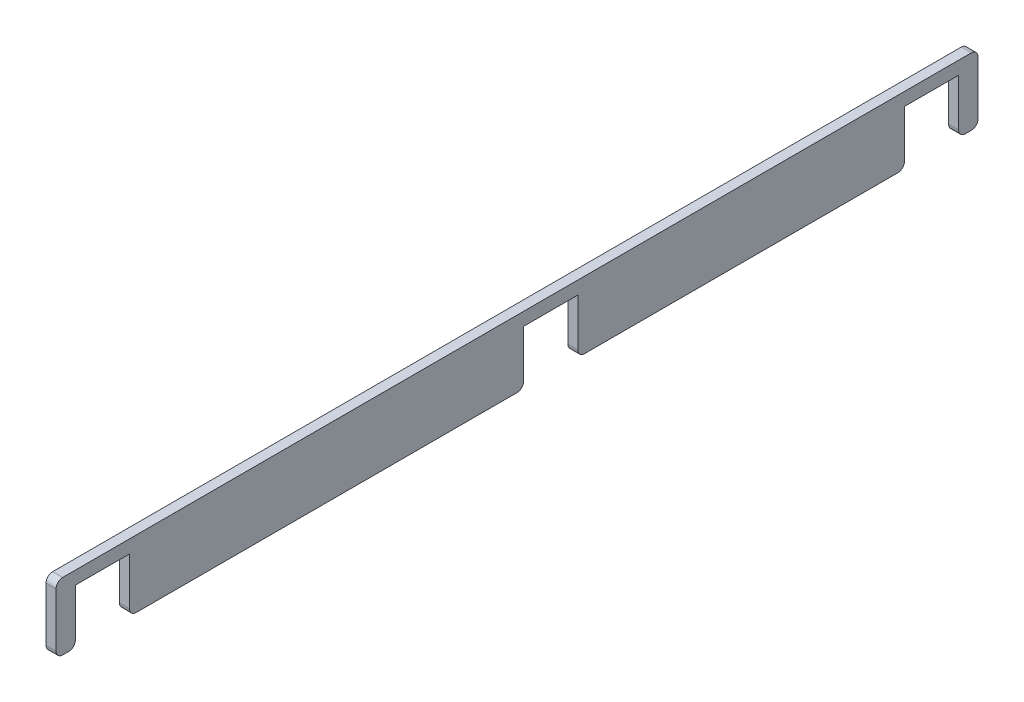
ISO-10303-21;
HEADER;
FILE_DESCRIPTION(('STEP AP214'),'2;1');
FILE_NAME('part.step','',(''),(''),'','','');
FILE_SCHEMA(('AUTOMOTIVE_DESIGN { 1 0 10303 214 1 1 1 1 }'));
ENDSEC;
DATA;
#1=APPLICATION_CONTEXT('core data for automotive mechanical design processes');
#2=APPLICATION_PROTOCOL_DEFINITION('international standard','automotive_design',2000,#1);
#3=PRODUCT_CONTEXT('',#1,'mechanical');
#4=PRODUCT('Part','Part','',(#3));
#5=PRODUCT_RELATED_PRODUCT_CATEGORY('part','',(#4));
#6=PRODUCT_DEFINITION_FORMATION('','',#4);
#7=PRODUCT_DEFINITION_CONTEXT('part definition',#1,'design');
#8=PRODUCT_DEFINITION('design','',#6,#7);
#9=PRODUCT_DEFINITION_SHAPE('','',#8);
#10=(LENGTH_UNIT() NAMED_UNIT(*) SI_UNIT(.MILLI.,.METRE.));
#11=(NAMED_UNIT(*) PLANE_ANGLE_UNIT() SI_UNIT($,.RADIAN.));
#12=(NAMED_UNIT(*) SI_UNIT($,.STERADIAN.) SOLID_ANGLE_UNIT());
#13=UNCERTAINTY_MEASURE_WITH_UNIT(LENGTH_MEASURE(1.E-05),#10,'distance_accuracy_value','');
#14=(GEOMETRIC_REPRESENTATION_CONTEXT(3) GLOBAL_UNCERTAINTY_ASSIGNED_CONTEXT((#13)) GLOBAL_UNIT_ASSIGNED_CONTEXT((#10,
#11,#12)) REPRESENTATION_CONTEXT('',''));
#15=CARTESIAN_POINT('',(0.,0.,0.));
#16=DIRECTION('',(0.,0.,1.));
#17=DIRECTION('',(1.,0.,0.));
#18=AXIS2_PLACEMENT_3D('',#15,#16,#17);
#19=CARTESIAN_POINT('',(-280.,-60.0000000000001,-690.));
#20=DIRECTION('',(-1.,0.,0.));
#21=DIRECTION('',(0.,0.,-1.));
#22=AXIS2_PLACEMENT_3D('',#19,#20,#21);
#23=PLANE('',#22);
#24=DIRECTION('',(0.,1.,0.));
#25=VECTOR('',#24,1.);
#26=CARTESIAN_POINT('',(-280.,-40.5,-580.));
#27=LINE('',#26,#25);
#28=CARTESIAN_POINT('',(-280.,-30.5000000000001,-580.));
#29=VERTEX_POINT('',#28);
#30=CARTESIAN_POINT('',(-280.,40.5,-580.));
#31=VERTEX_POINT('',#30);
#32=EDGE_CURVE('E468',#29,#31,#27,.T.);
#33=ORIENTED_EDGE('',*,*,#32,.T.);
#34=DIRECTION('',(0.,0.,-1.));
#35=VECTOR('',#34,1.);
#36=CARTESIAN_POINT('',(-280.,40.5,-580.));
#37=LINE('',#36,#35);
#38=CARTESIAN_POINT('',(-280.,40.5,-661.));
#39=VERTEX_POINT('',#38);
#40=EDGE_CURVE('E449',#31,#39,#37,.T.);
#41=ORIENTED_EDGE('',*,*,#40,.T.);
#42=DIRECTION('',(0.,-1.,0.));
#43=VECTOR('',#42,1.);
#44=CARTESIAN_POINT('',(-280.,-40.5,-661.));
#45=LINE('',#44,#43);
#46=CARTESIAN_POINT('',(-280.,-30.5000000000001,-661.));
#47=VERTEX_POINT('',#46);
#48=EDGE_CURVE('E462',#39,#47,#45,.T.);
#49=ORIENTED_EDGE('',*,*,#48,.T.);
#50=CARTESIAN_POINT('',(-280.,-30.5000000000001,-671.));
#51=DIRECTION('',(1.,0.,0.));
#52=DIRECTION('',(0.,0.,-1.));
#53=AXIS2_PLACEMENT_3D('',#50,#51,#52);
#54=CIRCLE('',#53,10.);
#55=CARTESIAN_POINT('',(-280.,-40.5,-671.));
#56=VERTEX_POINT('',#55);
#57=EDGE_CURVE('E362',#56,#47,#54,.F.);
#58=ORIENTED_EDGE('',*,*,#57,.F.);
#59=DIRECTION('',(0.,0.,1.));
#60=VECTOR('',#59,1.);
#61=CARTESIAN_POINT('',(-280.,-40.5,-690.));
#62=LINE('',#61,#60);
#63=CARTESIAN_POINT('',(-280.,-40.5,-680.));
#64=VERTEX_POINT('',#63);
#65=EDGE_CURVE('E510',#64,#56,#62,.T.);
#66=ORIENTED_EDGE('',*,*,#65,.F.);
#67=CARTESIAN_POINT('',(-280.,-30.5000000000001,-680.));
#68=DIRECTION('',(1.,0.,0.));
#69=DIRECTION('',(0.,0.,-1.));
#70=AXIS2_PLACEMENT_3D('',#67,#68,#69);
#71=CIRCLE('',#70,10.);
#72=CARTESIAN_POINT('',(-280.,-30.5000000000001,-690.));
#73=VERTEX_POINT('',#72);
#74=EDGE_CURVE('E358',#73,#64,#71,.F.);
#75=ORIENTED_EDGE('',*,*,#74,.F.);
#76=DIRECTION('',(0.,1.,0.));
#77=VECTOR('',#76,1.);
#78=CARTESIAN_POINT('',(-280.,-60.0000000000001,-690.));
#79=LINE('',#78,#77);
#80=CARTESIAN_POINT('',(-280.,50.,-690.));
#81=VERTEX_POINT('',#80);
#82=EDGE_CURVE('E433',#73,#81,#79,.T.);
#83=ORIENTED_EDGE('',*,*,#82,.T.);
#84=CARTESIAN_POINT('',(-280.,50.,-680.));
#85=DIRECTION('',(1.,0.,0.));
#86=DIRECTION('',(0.,0.,-1.));
#87=AXIS2_PLACEMENT_3D('',#84,#85,#86);
#88=CIRCLE('',#87,10.);
#89=CARTESIAN_POINT('',(-280.,60.0000000000001,-680.));
#90=VERTEX_POINT('',#89);
#91=EDGE_CURVE('E337',#90,#81,#88,.F.);
#92=ORIENTED_EDGE('',*,*,#91,.F.);
#93=DIRECTION('',(0.,0.,1.));
#94=VECTOR('',#93,1.);
#95=CARTESIAN_POINT('',(-280.,60.0000000000001,-690.));
#96=LINE('',#95,#94);
#97=CARTESIAN_POINT('',(-280.,60.0000000000001,680.));
#98=VERTEX_POINT('',#97);
#99=EDGE_CURVE('E422',#90,#98,#96,.T.);
#100=ORIENTED_EDGE('',*,*,#99,.T.);
#101=CARTESIAN_POINT('',(-280.,50.,680.));
#102=DIRECTION('',(1.,0.,0.));
#103=DIRECTION('',(0.,0.,-1.));
#104=AXIS2_PLACEMENT_3D('',#101,#102,#103);
#105=CIRCLE('',#104,10.);
#106=CARTESIAN_POINT('',(-280.,50.,690.));
#107=VERTEX_POINT('',#106);
#108=EDGE_CURVE('E334',#107,#98,#105,.F.);
#109=ORIENTED_EDGE('',*,*,#108,.F.);
#110=DIRECTION('',(0.,1.,0.));
#111=VECTOR('',#110,1.);
#112=CARTESIAN_POINT('',(-280.,-60.0000000000001,690.));
#113=LINE('',#112,#111);
#114=CARTESIAN_POINT('',(-280.,-30.5,690.));
#115=VERTEX_POINT('',#114);
#116=EDGE_CURVE('E244',#115,#107,#113,.T.);
#117=ORIENTED_EDGE('',*,*,#116,.F.);
#118=CARTESIAN_POINT('',(-280.,-30.5,680.));
#119=DIRECTION('',(1.,0.,0.));
#120=DIRECTION('',(0.,0.,-1.));
#121=AXIS2_PLACEMENT_3D('',#118,#119,#120);
#122=CIRCLE('',#121,10.);
#123=CARTESIAN_POINT('',(-280.,-40.5,680.));
#124=VERTEX_POINT('',#123);
#125=EDGE_CURVE('E340',#124,#115,#122,.F.);
#126=ORIENTED_EDGE('',*,*,#125,.F.);
#127=CARTESIAN_POINT('',(-280.,-40.5,671.));
#128=VERTEX_POINT('',#127);
#129=EDGE_CURVE('E519',#128,#124,#62,.T.);
#130=ORIENTED_EDGE('',*,*,#129,.F.);
#131=CARTESIAN_POINT('',(-280.,-30.5,671.));
#132=DIRECTION('',(1.,0.,0.));
#133=DIRECTION('',(0.,0.,-1.));
#134=AXIS2_PLACEMENT_3D('',#131,#132,#133);
#135=CIRCLE('',#134,10.);
#136=CARTESIAN_POINT('',(-280.,-30.5,661.));
#137=VERTEX_POINT('',#136);
#138=EDGE_CURVE('E344',#137,#128,#135,.F.);
#139=ORIENTED_EDGE('',*,*,#138,.F.);
#140=DIRECTION('',(0.,1.,0.));
#141=VECTOR('',#140,1.);
#142=CARTESIAN_POINT('',(-280.,-40.5,661.));
#143=LINE('',#142,#141);
#144=CARTESIAN_POINT('',(-280.,40.5,661.));
#145=VERTEX_POINT('',#144);
#146=EDGE_CURVE('E238',#137,#145,#143,.T.);
#147=ORIENTED_EDGE('',*,*,#146,.T.);
#148=DIRECTION('',(0.,0.,-1.));
#149=VECTOR('',#148,1.);
#150=CARTESIAN_POINT('',(-280.,40.5,661.));
#151=LINE('',#150,#149);
#152=CARTESIAN_POINT('',(-280.,40.5,580.));
#153=VERTEX_POINT('',#152);
#154=EDGE_CURVE('E218',#145,#153,#151,.T.);
#155=ORIENTED_EDGE('',*,*,#154,.T.);
#156=DIRECTION('',(0.,-1.,0.));
#157=VECTOR('',#156,1.);
#158=CARTESIAN_POINT('',(-280.,-40.5,580.));
#159=LINE('',#158,#157);
#160=CARTESIAN_POINT('',(-280.,-30.5,580.));
#161=VERTEX_POINT('',#160);
#162=EDGE_CURVE('E230',#153,#161,#159,.T.);
#163=ORIENTED_EDGE('',*,*,#162,.T.);
#164=CARTESIAN_POINT('',(-280.,-30.5,570.));
#165=DIRECTION('',(1.,0.,0.));
#166=DIRECTION('',(0.,0.,-1.));
#167=AXIS2_PLACEMENT_3D('',#164,#165,#166);
#168=CIRCLE('',#167,10.);
#169=CARTESIAN_POINT('',(-280.,-40.5,570.));
#170=VERTEX_POINT('',#169);
#171=EDGE_CURVE('E347',#170,#161,#168,.F.);
#172=ORIENTED_EDGE('',*,*,#171,.F.);
#173=CARTESIAN_POINT('',(-280.,-40.5,0.));
#174=VERTEX_POINT('',#173);
#175=EDGE_CURVE('E514',#174,#170,#62,.T.);
#176=ORIENTED_EDGE('',*,*,#175,.F.);
#177=CARTESIAN_POINT('',(-280.,-30.5,0.));
#178=DIRECTION('',(1.,0.,0.));
#179=DIRECTION('',(0.,0.,-1.));
#180=AXIS2_PLACEMENT_3D('',#177,#178,#179);
#181=CIRCLE('',#180,10.);
#182=CARTESIAN_POINT('',(-280.,-30.5,-10.));
#183=VERTEX_POINT('',#182);
#184=EDGE_CURVE('E354',#183,#174,#181,.F.);
#185=ORIENTED_EDGE('',*,*,#184,.F.);
#186=DIRECTION('',(0.,1.,0.));
#187=VECTOR('',#186,1.);
#188=CARTESIAN_POINT('',(-280.,-40.5,-10.));
#189=LINE('',#188,#187);
#190=CARTESIAN_POINT('',(-280.,40.5,-10.));
#191=VERTEX_POINT('',#190);
#192=EDGE_CURVE('E256',#183,#191,#189,.T.);
#193=ORIENTED_EDGE('',*,*,#192,.T.);
#194=DIRECTION('',(0.,0.,-1.));
#195=VECTOR('',#194,1.);
#196=CARTESIAN_POINT('',(-280.,40.5,-10.));
#197=LINE('',#196,#195);
#198=CARTESIAN_POINT('',(-280.,40.5,-91.));
#199=VERTEX_POINT('',#198);
#200=EDGE_CURVE('E596',#191,#199,#197,.T.);
#201=ORIENTED_EDGE('',*,*,#200,.T.);
#202=DIRECTION('',(0.,-1.,0.));
#203=VECTOR('',#202,1.);
#204=CARTESIAN_POINT('',(-280.,-40.5,-91.));
#205=LINE('',#204,#203);
#206=CARTESIAN_POINT('',(-280.,-30.5,-91.));
#207=VERTEX_POINT('',#206);
#208=EDGE_CURVE('E588',#199,#207,#205,.T.);
#209=ORIENTED_EDGE('',*,*,#208,.T.);
#210=CARTESIAN_POINT('',(-280.,-30.5,-101.));
#211=DIRECTION('',(1.,0.,0.));
#212=DIRECTION('',(0.,0.,-1.));
#213=AXIS2_PLACEMENT_3D('',#210,#211,#212);
#214=CIRCLE('',#213,10.);
#215=CARTESIAN_POINT('',(-280.,-40.5,-101.));
#216=VERTEX_POINT('',#215);
#217=EDGE_CURVE('E350',#216,#207,#214,.F.);
#218=ORIENTED_EDGE('',*,*,#217,.F.);
#219=CARTESIAN_POINT('',(-280.,-40.5,-570.));
#220=VERTEX_POINT('',#219);
#221=EDGE_CURVE('E513',#220,#216,#62,.T.);
#222=ORIENTED_EDGE('',*,*,#221,.F.);
#223=CARTESIAN_POINT('',(-280.,-30.5000000000001,-570.));
#224=DIRECTION('',(1.,0.,0.));
#225=DIRECTION('',(0.,0.,-1.));
#226=AXIS2_PLACEMENT_3D('',#223,#224,#225);
#227=CIRCLE('',#226,10.);
#228=EDGE_CURVE('E366',#29,#220,#227,.F.);
#229=ORIENTED_EDGE('',*,*,#228,.F.);
#230=EDGE_LOOP('',(#33,#41,#49,#58,#66,#75,#83,#92,#100,#109,#117,#126,#130,#139,#147,#155,#163,
#172,#176,#185,#193,#201,#209,#218,#222,#229));
#231=FACE_BOUND('',#230,.T.);
#232=ADVANCED_FACE('F41',(#231),#23,.F.);
#233=CARTESIAN_POINT('',(-295.,60.0000000000001,-690.));
#234=DIRECTION('',(0.,-1.,0.));
#235=DIRECTION('',(0.,0.,-1.));
#236=AXIS2_PLACEMENT_3D('',#233,#234,#235);
#237=PLANE('',#236);
#238=DIRECTION('',(0.,0.,1.));
#239=VECTOR('',#238,1.);
#240=CARTESIAN_POINT('',(-295.,60.0000000000001,-690.));
#241=LINE('',#240,#239);
#242=CARTESIAN_POINT('',(-295.,60.0000000000001,-680.));
#243=VERTEX_POINT('',#242);
#244=CARTESIAN_POINT('',(-295.,60.0000000000001,680.));
#245=VERTEX_POINT('',#244);
#246=EDGE_CURVE('E418',#243,#245,#241,.T.);
#247=ORIENTED_EDGE('',*,*,#246,.T.);
#248=DIRECTION('',(-1.,0.,0.));
#249=VECTOR('',#248,1.);
#250=CARTESIAN_POINT('',(-295.,60.0000000000001,680.));
#251=LINE('',#250,#249);
#252=EDGE_CURVE('E50',#98,#245,#251,.T.);
#253=ORIENTED_EDGE('',*,*,#252,.F.);
#254=ORIENTED_EDGE('',*,*,#99,.F.);
#255=DIRECTION('',(-1.,0.,0.));
#256=VECTOR('',#255,1.);
#257=CARTESIAN_POINT('',(-295.,60.0000000000001,-680.));
#258=LINE('',#257,#256);
#259=EDGE_CURVE('E12',#243,#90,#258,.F.);
#260=ORIENTED_EDGE('',*,*,#259,.F.);
#261=EDGE_LOOP('',(#247,#253,#254,#260));
#262=FACE_BOUND('',#261,.T.);
#263=ADVANCED_FACE('F419',(#262),#237,.F.);
#264=CARTESIAN_POINT('',(-295.,-60.0000000000001,-690.));
#265=DIRECTION('',(1.,0.,0.));
#266=DIRECTION('',(0.,0.,1.));
#267=AXIS2_PLACEMENT_3D('',#264,#265,#266);
#268=PLANE('',#267);
#269=DIRECTION('',(0.,0.,1.));
#270=VECTOR('',#269,1.);
#271=CARTESIAN_POINT('',(-295.,-40.5,-690.));
#272=LINE('',#271,#270);
#273=CARTESIAN_POINT('',(-295.,-40.5,-570.));
#274=VERTEX_POINT('',#273);
#275=CARTESIAN_POINT('',(-295.,-40.5,-101.));
#276=VERTEX_POINT('',#275);
#277=EDGE_CURVE('E531',#274,#276,#272,.T.);
#278=ORIENTED_EDGE('',*,*,#277,.T.);
#279=CARTESIAN_POINT('',(-295.,-30.5,-101.));
#280=DIRECTION('',(-1.,0.,0.));
#281=DIRECTION('',(0.,0.,1.));
#282=AXIS2_PLACEMENT_3D('',#279,#280,#281);
#283=CIRCLE('',#282,10.);
#284=CARTESIAN_POINT('',(-295.,-30.5000000000001,-91.));
#285=VERTEX_POINT('',#284);
#286=EDGE_CURVE('E305',#285,#276,#283,.F.);
#287=ORIENTED_EDGE('',*,*,#286,.F.);
#288=DIRECTION('',(0.,1.,0.));
#289=VECTOR('',#288,1.);
#290=CARTESIAN_POINT('',(-295.,-40.5,-91.));
#291=LINE('',#290,#289);
#292=CARTESIAN_POINT('',(-295.,40.5,-91.));
#293=VERTEX_POINT('',#292);
#294=EDGE_CURVE('E592',#285,#293,#291,.T.);
#295=ORIENTED_EDGE('',*,*,#294,.T.);
#296=DIRECTION('',(0.,0.,1.));
#297=VECTOR('',#296,1.);
#298=CARTESIAN_POINT('',(-295.,40.5,-10.));
#299=LINE('',#298,#297);
#300=CARTESIAN_POINT('',(-295.,40.5,-10.));
#301=VERTEX_POINT('',#300);
#302=EDGE_CURVE('E956',#293,#301,#299,.T.);
#303=ORIENTED_EDGE('',*,*,#302,.T.);
#304=DIRECTION('',(0.,-1.,0.));
#305=VECTOR('',#304,1.);
#306=CARTESIAN_POINT('',(-295.,-40.5,-10.));
#307=LINE('',#306,#305);
#308=CARTESIAN_POINT('',(-295.,-30.5000000000001,-10.));
#309=VERTEX_POINT('',#308);
#310=EDGE_CURVE('E960',#301,#309,#307,.T.);
#311=ORIENTED_EDGE('',*,*,#310,.T.);
#312=CARTESIAN_POINT('',(-295.,-30.5,0.));
#313=DIRECTION('',(-1.,0.,0.));
#314=DIRECTION('',(0.,0.,1.));
#315=AXIS2_PLACEMENT_3D('',#312,#313,#314);
#316=CIRCLE('',#315,10.);
#317=CARTESIAN_POINT('',(-295.,-40.5,0.));
#318=VERTEX_POINT('',#317);
#319=EDGE_CURVE('E315',#318,#309,#316,.F.);
#320=ORIENTED_EDGE('',*,*,#319,.F.);
#321=CARTESIAN_POINT('',(-295.,-40.5,570.));
#322=VERTEX_POINT('',#321);
#323=EDGE_CURVE('E532',#318,#322,#272,.T.);
#324=ORIENTED_EDGE('',*,*,#323,.T.);
#325=CARTESIAN_POINT('',(-295.,-30.5,570.));
#326=DIRECTION('',(-1.,0.,0.));
#327=DIRECTION('',(0.,0.,1.));
#328=AXIS2_PLACEMENT_3D('',#325,#326,#327);
#329=CIRCLE('',#328,10.);
#330=CARTESIAN_POINT('',(-295.,-30.5,580.));
#331=VERTEX_POINT('',#330);
#332=EDGE_CURVE('E298',#331,#322,#329,.F.);
#333=ORIENTED_EDGE('',*,*,#332,.F.);
#334=DIRECTION('',(0.,1.,0.));
#335=VECTOR('',#334,1.);
#336=CARTESIAN_POINT('',(-295.,-40.5,580.));
#337=LINE('',#336,#335);
#338=CARTESIAN_POINT('',(-295.,40.5,580.));
#339=VERTEX_POINT('',#338);
#340=EDGE_CURVE('E237',#331,#339,#337,.T.);
#341=ORIENTED_EDGE('',*,*,#340,.T.);
#342=DIRECTION('',(0.,0.,1.));
#343=VECTOR('',#342,1.);
#344=CARTESIAN_POINT('',(-295.,40.5,661.));
#345=LINE('',#344,#343);
#346=CARTESIAN_POINT('',(-295.,40.5,661.));
#347=VERTEX_POINT('',#346);
#348=EDGE_CURVE('E221',#339,#347,#345,.T.);
#349=ORIENTED_EDGE('',*,*,#348,.T.);
#350=DIRECTION('',(0.,-1.,0.));
#351=VECTOR('',#350,1.);
#352=CARTESIAN_POINT('',(-295.,-40.5,661.));
#353=LINE('',#352,#351);
#354=CARTESIAN_POINT('',(-295.,-30.5,661.));
#355=VERTEX_POINT('',#354);
#356=EDGE_CURVE('E227',#347,#355,#353,.T.);
#357=ORIENTED_EDGE('',*,*,#356,.T.);
#358=CARTESIAN_POINT('',(-295.,-30.5,671.));
#359=DIRECTION('',(-1.,0.,0.));
#360=DIRECTION('',(0.,0.,1.));
#361=AXIS2_PLACEMENT_3D('',#358,#359,#360);
#362=CIRCLE('',#361,10.);
#363=CARTESIAN_POINT('',(-295.,-40.5,671.));
#364=VERTEX_POINT('',#363);
#365=EDGE_CURVE('E285',#364,#355,#362,.F.);
#366=ORIENTED_EDGE('',*,*,#365,.F.);
#367=CARTESIAN_POINT('',(-295.,-40.5,680.));
#368=VERTEX_POINT('',#367);
#369=EDGE_CURVE('E535',#364,#368,#272,.T.);
#370=ORIENTED_EDGE('',*,*,#369,.T.);
#371=CARTESIAN_POINT('',(-295.,-30.5,680.));
#372=DIRECTION('',(-1.,0.,0.));
#373=DIRECTION('',(0.,0.,1.));
#374=AXIS2_PLACEMENT_3D('',#371,#372,#373);
#375=CIRCLE('',#374,10.);
#376=CARTESIAN_POINT('',(-295.,-30.5,690.));
#377=VERTEX_POINT('',#376);
#378=EDGE_CURVE('E299',#377,#368,#375,.F.);
#379=ORIENTED_EDGE('',*,*,#378,.F.);
#380=DIRECTION('',(0.,-1.,0.));
#381=VECTOR('',#380,1.);
#382=CARTESIAN_POINT('',(-295.,-60.0000000000001,690.));
#383=LINE('',#382,#381);
#384=CARTESIAN_POINT('',(-295.,50.,690.));
#385=VERTEX_POINT('',#384);
#386=EDGE_CURVE('E250',#385,#377,#383,.T.);
#387=ORIENTED_EDGE('',*,*,#386,.F.);
#388=CARTESIAN_POINT('',(-295.,50.,680.));
#389=DIRECTION('',(-1.,0.,0.));
#390=DIRECTION('',(0.,0.,1.));
#391=AXIS2_PLACEMENT_3D('',#388,#389,#390);
#392=CIRCLE('',#391,10.);
#393=EDGE_CURVE('E413',#245,#385,#392,.F.);
#394=ORIENTED_EDGE('',*,*,#393,.F.);
#395=ORIENTED_EDGE('',*,*,#246,.F.);
#396=CARTESIAN_POINT('',(-295.,50.,-680.));
#397=DIRECTION('',(-1.,0.,0.));
#398=DIRECTION('',(0.,0.,1.));
#399=AXIS2_PLACEMENT_3D('',#396,#397,#398);
#400=CIRCLE('',#399,10.);
#401=CARTESIAN_POINT('',(-295.,50.,-690.));
#402=VERTEX_POINT('',#401);
#403=EDGE_CURVE('E308',#402,#243,#400,.F.);
#404=ORIENTED_EDGE('',*,*,#403,.F.);
#405=DIRECTION('',(0.,-1.,0.));
#406=VECTOR('',#405,1.);
#407=CARTESIAN_POINT('',(-295.,-60.0000000000001,-690.));
#408=LINE('',#407,#406);
#409=CARTESIAN_POINT('',(-295.,-30.5000000000001,-690.));
#410=VERTEX_POINT('',#409);
#411=EDGE_CURVE('E423',#402,#410,#408,.T.);
#412=ORIENTED_EDGE('',*,*,#411,.T.);
#413=CARTESIAN_POINT('',(-295.,-30.5000000000001,-680.));
#414=DIRECTION('',(-1.,0.,0.));
#415=DIRECTION('',(0.,0.,1.));
#416=AXIS2_PLACEMENT_3D('',#413,#414,#415);
#417=CIRCLE('',#416,10.);
#418=CARTESIAN_POINT('',(-295.,-40.5,-680.));
#419=VERTEX_POINT('',#418);
#420=EDGE_CURVE('E319',#419,#410,#417,.F.);
#421=ORIENTED_EDGE('',*,*,#420,.F.);
#422=CARTESIAN_POINT('',(-295.,-40.5,-671.));
#423=VERTEX_POINT('',#422);
#424=EDGE_CURVE('E499',#419,#423,#272,.T.);
#425=ORIENTED_EDGE('',*,*,#424,.T.);
#426=CARTESIAN_POINT('',(-295.,-30.5000000000001,-671.));
#427=DIRECTION('',(-1.,0.,0.));
#428=DIRECTION('',(0.,0.,1.));
#429=AXIS2_PLACEMENT_3D('',#426,#427,#428);
#430=CIRCLE('',#429,10.);
#431=CARTESIAN_POINT('',(-295.,-30.5000000000001,-661.));
#432=VERTEX_POINT('',#431);
#433=EDGE_CURVE('E323',#432,#423,#430,.F.);
#434=ORIENTED_EDGE('',*,*,#433,.F.);
#435=DIRECTION('',(0.,1.,0.));
#436=VECTOR('',#435,1.);
#437=CARTESIAN_POINT('',(-295.,-40.5,-661.));
#438=LINE('',#437,#436);
#439=CARTESIAN_POINT('',(-295.,40.5,-661.));
#440=VERTEX_POINT('',#439);
#441=EDGE_CURVE('E467',#432,#440,#438,.T.);
#442=ORIENTED_EDGE('',*,*,#441,.T.);
#443=DIRECTION('',(0.,0.,1.));
#444=VECTOR('',#443,1.);
#445=CARTESIAN_POINT('',(-295.,40.5,-580.));
#446=LINE('',#445,#444);
#447=CARTESIAN_POINT('',(-295.,40.5,-580.));
#448=VERTEX_POINT('',#447);
#449=EDGE_CURVE('E474',#440,#448,#446,.T.);
#450=ORIENTED_EDGE('',*,*,#449,.T.);
#451=DIRECTION('',(0.,-1.,0.));
#452=VECTOR('',#451,1.);
#453=CARTESIAN_POINT('',(-295.,-40.5,-580.));
#454=LINE('',#453,#452);
#455=CARTESIAN_POINT('',(-295.,-30.5000000000001,-580.));
#456=VERTEX_POINT('',#455);
#457=EDGE_CURVE('E478',#448,#456,#454,.T.);
#458=ORIENTED_EDGE('',*,*,#457,.T.);
#459=CARTESIAN_POINT('',(-295.,-30.5000000000001,-570.));
#460=DIRECTION('',(-1.,0.,0.));
#461=DIRECTION('',(0.,0.,1.));
#462=AXIS2_PLACEMENT_3D('',#459,#460,#461);
#463=CIRCLE('',#462,10.);
#464=EDGE_CURVE('E327',#274,#456,#463,.F.);
#465=ORIENTED_EDGE('',*,*,#464,.F.);
#466=EDGE_LOOP('',(#278,#287,#295,#303,#311,#320,#324,#333,#341,#349,#357,#366,#370,#379,#387,
#394,#395,#404,#412,#421,#425,#434,#442,#450,#458,#465));
#467=FACE_BOUND('',#466,.T.);
#468=ADVANCED_FACE('F282',(#467),#268,.F.);
#469=CARTESIAN_POINT('',(0.,0.,-690.));
#470=DIRECTION('',(0.,0.,1.));
#471=DIRECTION('',(-1.,0.,0.));
#472=AXIS2_PLACEMENT_3D('',#469,#470,#471);
#473=PLANE('',#472);
#474=ORIENTED_EDGE('',*,*,#411,.F.);
#475=DIRECTION('',(-1.,0.,0.));
#476=VECTOR('',#475,1.);
#477=CARTESIAN_POINT('',(0.,50.,-690.));
#478=LINE('',#477,#476);
#479=EDGE_CURVE('E379',#81,#402,#478,.T.);
#480=ORIENTED_EDGE('',*,*,#479,.F.);
#481=ORIENTED_EDGE('',*,*,#82,.F.);
#482=DIRECTION('',(-1.,0.,0.));
#483=VECTOR('',#482,1.);
#484=CARTESIAN_POINT('',(0.,-30.5000000000001,-690.));
#485=LINE('',#484,#483);
#486=EDGE_CURVE('E382',#410,#73,#485,.F.);
#487=ORIENTED_EDGE('',*,*,#486,.F.);
#488=EDGE_LOOP('',(#474,#480,#481,#487));
#489=FACE_BOUND('',#488,.T.);
#490=ADVANCED_FACE('F645',(#489),#473,.F.);
#491=CARTESIAN_POINT('',(0.,0.,690.));
#492=DIRECTION('',(0.,0.,1.));
#493=DIRECTION('',(-1.,0.,0.));
#494=AXIS2_PLACEMENT_3D('',#491,#492,#493);
#495=PLANE('',#494);
#496=ORIENTED_EDGE('',*,*,#116,.T.);
#497=DIRECTION('',(-1.,0.,0.));
#498=VECTOR('',#497,1.);
#499=CARTESIAN_POINT('',(-280.,50.,690.));
#500=LINE('',#499,#498);
#501=EDGE_CURVE('E292',#385,#107,#500,.F.);
#502=ORIENTED_EDGE('',*,*,#501,.F.);
#503=ORIENTED_EDGE('',*,*,#386,.T.);
#504=DIRECTION('',(-1.,0.,0.));
#505=VECTOR('',#504,1.);
#506=CARTESIAN_POINT('',(-295.,-30.5,690.));
#507=LINE('',#506,#505);
#508=EDGE_CURVE('E406',#115,#377,#507,.T.);
#509=ORIENTED_EDGE('',*,*,#508,.F.);
#510=EDGE_LOOP('',(#496,#502,#503,#509));
#511=FACE_BOUND('',#510,.T.);
#512=ADVANCED_FACE('F552',(#511),#495,.T.);
#513=CARTESIAN_POINT('',(-279.999,-40.5,-661.));
#514=DIRECTION('',(0.,0.,-1.));
#515=DIRECTION('',(1.,0.,0.));
#516=AXIS2_PLACEMENT_3D('',#513,#514,#515);
#517=PLANE('',#516);
#518=ORIENTED_EDGE('',*,*,#48,.F.);
#519=DIRECTION('',(-1.,0.,0.));
#520=VECTOR('',#519,1.);
#521=CARTESIAN_POINT('',(-279.999,40.5,-661.));
#522=LINE('',#521,#520);
#523=EDGE_CURVE('E455',#39,#440,#522,.T.);
#524=ORIENTED_EDGE('',*,*,#523,.T.);
#525=ORIENTED_EDGE('',*,*,#441,.F.);
#526=DIRECTION('',(-1.,0.,0.));
#527=VECTOR('',#526,1.);
#528=CARTESIAN_POINT('',(-279.999,-30.5000000000001,-661.));
#529=LINE('',#528,#527);
#530=EDGE_CURVE('E370',#47,#432,#529,.T.);
#531=ORIENTED_EDGE('',*,*,#530,.F.);
#532=EDGE_LOOP('',(#518,#524,#525,#531));
#533=FACE_BOUND('',#532,.T.);
#534=ADVANCED_FACE('F493',(#533),#517,.F.);
#535=CARTESIAN_POINT('',(-279.999,-40.5,-580.));
#536=DIRECTION('',(0.,0.,1.));
#537=DIRECTION('',(-1.,0.,0.));
#538=AXIS2_PLACEMENT_3D('',#535,#536,#537);
#539=PLANE('',#538);
#540=ORIENTED_EDGE('',*,*,#457,.F.);
#541=DIRECTION('',(-1.,0.,0.));
#542=VECTOR('',#541,1.);
#543=CARTESIAN_POINT('',(-279.999,40.5,-580.));
#544=LINE('',#543,#542);
#545=EDGE_CURVE('E454',#31,#448,#544,.T.);
#546=ORIENTED_EDGE('',*,*,#545,.F.);
#547=ORIENTED_EDGE('',*,*,#32,.F.);
#548=DIRECTION('',(-1.,0.,0.));
#549=VECTOR('',#548,1.);
#550=CARTESIAN_POINT('',(-279.999,-30.5000000000001,-580.));
#551=LINE('',#550,#549);
#552=EDGE_CURVE('E331',#456,#29,#551,.F.);
#553=ORIENTED_EDGE('',*,*,#552,.F.);
#554=EDGE_LOOP('',(#540,#546,#547,#553));
#555=FACE_BOUND('',#554,.T.);
#556=ADVANCED_FACE('F851',(#555),#539,.F.);
#557=CARTESIAN_POINT('',(-279.999,40.5,-580.));
#558=DIRECTION('',(0.,1.,0.));
#559=DIRECTION('',(0.,0.,1.));
#560=AXIS2_PLACEMENT_3D('',#557,#558,#559);
#561=PLANE('',#560);
#562=ORIENTED_EDGE('',*,*,#40,.F.);
#563=ORIENTED_EDGE('',*,*,#545,.T.);
#564=ORIENTED_EDGE('',*,*,#449,.F.);
#565=ORIENTED_EDGE('',*,*,#523,.F.);
#566=EDGE_LOOP('',(#562,#563,#564,#565));
#567=FACE_BOUND('',#566,.T.);
#568=ADVANCED_FACE('F495',(#567),#561,.F.);
#569=CARTESIAN_POINT('',(-279.999,-40.5,-91.));
#570=DIRECTION('',(0.,0.,-1.));
#571=DIRECTION('',(1.,0.,0.));
#572=AXIS2_PLACEMENT_3D('',#569,#570,#571);
#573=PLANE('',#572);
#574=ORIENTED_EDGE('',*,*,#208,.F.);
#575=DIRECTION('',(-1.,0.,0.));
#576=VECTOR('',#575,1.);
#577=CARTESIAN_POINT('',(-279.999,40.5,-91.));
#578=LINE('',#577,#576);
#579=EDGE_CURVE('E966',#199,#293,#578,.T.);
#580=ORIENTED_EDGE('',*,*,#579,.T.);
#581=ORIENTED_EDGE('',*,*,#294,.F.);
#582=DIRECTION('',(-1.,0.,0.));
#583=VECTOR('',#582,1.);
#584=CARTESIAN_POINT('',(-279.999,-30.5,-91.));
#585=LINE('',#584,#583);
#586=EDGE_CURVE('E394',#207,#285,#585,.T.);
#587=ORIENTED_EDGE('',*,*,#586,.F.);
#588=EDGE_LOOP('',(#574,#580,#581,#587));
#589=FACE_BOUND('',#588,.T.);
#590=ADVANCED_FACE('F834',(#589),#573,.F.);
#591=CARTESIAN_POINT('',(-279.999,-40.5,-10.));
#592=DIRECTION('',(0.,0.,1.));
#593=DIRECTION('',(-1.,0.,0.));
#594=AXIS2_PLACEMENT_3D('',#591,#592,#593);
#595=PLANE('',#594);
#596=ORIENTED_EDGE('',*,*,#310,.F.);
#597=DIRECTION('',(-1.,0.,0.));
#598=VECTOR('',#597,1.);
#599=CARTESIAN_POINT('',(-279.999,40.5,-10.));
#600=LINE('',#599,#598);
#601=EDGE_CURVE('E600',#191,#301,#600,.T.);
#602=ORIENTED_EDGE('',*,*,#601,.F.);
#603=ORIENTED_EDGE('',*,*,#192,.F.);
#604=DIRECTION('',(-1.,0.,0.));
#605=VECTOR('',#604,1.);
#606=CARTESIAN_POINT('',(-279.999,-30.5,-10.));
#607=LINE('',#606,#605);
#608=EDGE_CURVE('E391',#309,#183,#607,.F.);
#609=ORIENTED_EDGE('',*,*,#608,.F.);
#610=EDGE_LOOP('',(#596,#602,#603,#609));
#611=FACE_BOUND('',#610,.T.);
#612=ADVANCED_FACE('F825',(#611),#595,.F.);
#613=CARTESIAN_POINT('',(-279.999,40.5,-10.));
#614=DIRECTION('',(0.,1.,0.));
#615=DIRECTION('',(0.,0.,1.));
#616=AXIS2_PLACEMENT_3D('',#613,#614,#615);
#617=PLANE('',#616);
#618=ORIENTED_EDGE('',*,*,#200,.F.);
#619=ORIENTED_EDGE('',*,*,#601,.T.);
#620=ORIENTED_EDGE('',*,*,#302,.F.);
#621=ORIENTED_EDGE('',*,*,#579,.F.);
#622=EDGE_LOOP('',(#618,#619,#620,#621));
#623=FACE_BOUND('',#622,.T.);
#624=ADVANCED_FACE('F816',(#623),#617,.F.);
#625=CARTESIAN_POINT('',(-279.999,-40.5,580.));
#626=DIRECTION('',(0.,0.,-1.));
#627=DIRECTION('',(1.,0.,0.));
#628=AXIS2_PLACEMENT_3D('',#625,#626,#627);
#629=PLANE('',#628);
#630=ORIENTED_EDGE('',*,*,#162,.F.);
#631=DIRECTION('',(-1.,0.,0.));
#632=VECTOR('',#631,1.);
#633=CARTESIAN_POINT('',(-279.999,40.5,580.));
#634=LINE('',#633,#632);
#635=EDGE_CURVE('E214',#153,#339,#634,.T.);
#636=ORIENTED_EDGE('',*,*,#635,.T.);
#637=ORIENTED_EDGE('',*,*,#340,.F.);
#638=DIRECTION('',(-1.,0.,0.));
#639=VECTOR('',#638,1.);
#640=CARTESIAN_POINT('',(-279.999,-30.5,580.));
#641=LINE('',#640,#639);
#642=EDGE_CURVE('E232',#161,#331,#641,.T.);
#643=ORIENTED_EDGE('',*,*,#642,.F.);
#644=EDGE_LOOP('',(#630,#636,#637,#643));
#645=FACE_BOUND('',#644,.T.);
#646=ADVANCED_FACE('F231',(#645),#629,.F.);
#647=CARTESIAN_POINT('',(-279.999,-40.5,661.));
#648=DIRECTION('',(0.,0.,1.));
#649=DIRECTION('',(-1.,0.,0.));
#650=AXIS2_PLACEMENT_3D('',#647,#648,#649);
#651=PLANE('',#650);
#652=ORIENTED_EDGE('',*,*,#356,.F.);
#653=DIRECTION('',(-1.,0.,0.));
#654=VECTOR('',#653,1.);
#655=CARTESIAN_POINT('',(-279.999,40.5,661.));
#656=LINE('',#655,#654);
#657=EDGE_CURVE('E226',#145,#347,#656,.T.);
#658=ORIENTED_EDGE('',*,*,#657,.F.);
#659=ORIENTED_EDGE('',*,*,#146,.F.);
#660=DIRECTION('',(-1.,0.,0.));
#661=VECTOR('',#660,1.);
#662=CARTESIAN_POINT('',(-279.999,-30.5,661.));
#663=LINE('',#662,#661);
#664=EDGE_CURVE('E288',#355,#137,#663,.F.);
#665=ORIENTED_EDGE('',*,*,#664,.F.);
#666=EDGE_LOOP('',(#652,#658,#659,#665));
#667=FACE_BOUND('',#666,.T.);
#668=ADVANCED_FACE('F287',(#667),#651,.F.);
#669=CARTESIAN_POINT('',(-279.999,40.5,661.));
#670=DIRECTION('',(0.,1.,0.));
#671=DIRECTION('',(0.,0.,1.));
#672=AXIS2_PLACEMENT_3D('',#669,#670,#671);
#673=PLANE('',#672);
#674=ORIENTED_EDGE('',*,*,#154,.F.);
#675=ORIENTED_EDGE('',*,*,#657,.T.);
#676=ORIENTED_EDGE('',*,*,#348,.F.);
#677=ORIENTED_EDGE('',*,*,#635,.F.);
#678=EDGE_LOOP('',(#674,#675,#676,#677));
#679=FACE_BOUND('',#678,.T.);
#680=ADVANCED_FACE('F216',(#679),#673,.F.);
#681=CARTESIAN_POINT('',(-280.,-40.5,-690.));
#682=DIRECTION('',(0.,1.,0.));
#683=DIRECTION('',(0.,0.,1.));
#684=AXIS2_PLACEMENT_3D('',#681,#682,#683);
#685=PLANE('',#684);
#686=ORIENTED_EDGE('',*,*,#129,.T.);
#687=DIRECTION('',(-1.,0.,0.));
#688=VECTOR('',#687,1.);
#689=CARTESIAN_POINT('',(-280.,-40.5,680.));
#690=LINE('',#689,#688);
#691=EDGE_CURVE('E399',#368,#124,#690,.F.);
#692=ORIENTED_EDGE('',*,*,#691,.F.);
#693=ORIENTED_EDGE('',*,*,#369,.F.);
#694=DIRECTION('',(-1.,0.,0.));
#695=VECTOR('',#694,1.);
#696=CARTESIAN_POINT('',(-280.,-40.5,671.));
#697=LINE('',#696,#695);
#698=EDGE_CURVE('E293',#128,#364,#697,.T.);
#699=ORIENTED_EDGE('',*,*,#698,.F.);
#700=EDGE_LOOP('',(#686,#692,#693,#699));
#701=FACE_BOUND('',#700,.T.);
#702=ADVANCED_FACE('F546',(#701),#685,.F.);
#703=ORIENTED_EDGE('',*,*,#175,.T.);
#704=DIRECTION('',(-1.,0.,0.));
#705=VECTOR('',#704,1.);
#706=CARTESIAN_POINT('',(-280.,-40.5,570.));
#707=LINE('',#706,#705);
#708=EDGE_CURVE('E385',#322,#170,#707,.F.);
#709=ORIENTED_EDGE('',*,*,#708,.F.);
#710=ORIENTED_EDGE('',*,*,#323,.F.);
#711=DIRECTION('',(-1.,0.,0.));
#712=VECTOR('',#711,1.);
#713=CARTESIAN_POINT('',(-280.,-40.5,0.));
#714=LINE('',#713,#712);
#715=EDGE_CURVE('E388',#174,#318,#714,.T.);
#716=ORIENTED_EDGE('',*,*,#715,.F.);
#717=EDGE_LOOP('',(#703,#709,#710,#716));
#718=FACE_BOUND('',#717,.T.);
#719=ADVANCED_FACE('F661',(#718),#685,.F.);
#720=ORIENTED_EDGE('',*,*,#221,.T.);
#721=DIRECTION('',(-1.,0.,0.));
#722=VECTOR('',#721,1.);
#723=CARTESIAN_POINT('',(-280.,-40.5,-101.));
#724=LINE('',#723,#722);
#725=EDGE_CURVE('E429',#276,#216,#724,.F.);
#726=ORIENTED_EDGE('',*,*,#725,.F.);
#727=ORIENTED_EDGE('',*,*,#277,.F.);
#728=DIRECTION('',(-1.,0.,0.));
#729=VECTOR('',#728,1.);
#730=CARTESIAN_POINT('',(-280.,-40.5,-570.));
#731=LINE('',#730,#729);
#732=EDGE_CURVE('E634',#220,#274,#731,.T.);
#733=ORIENTED_EDGE('',*,*,#732,.F.);
#734=EDGE_LOOP('',(#720,#726,#727,#733));
#735=FACE_BOUND('',#734,.T.);
#736=ADVANCED_FACE('F653',(#735),#685,.F.);
#737=ORIENTED_EDGE('',*,*,#424,.F.);
#738=DIRECTION('',(-1.,0.,0.));
#739=VECTOR('',#738,1.);
#740=CARTESIAN_POINT('',(-280.,-40.5,-680.));
#741=LINE('',#740,#739);
#742=EDGE_CURVE('E373',#64,#419,#741,.T.);
#743=ORIENTED_EDGE('',*,*,#742,.F.);
#744=ORIENTED_EDGE('',*,*,#65,.T.);
#745=DIRECTION('',(-1.,0.,0.));
#746=VECTOR('',#745,1.);
#747=CARTESIAN_POINT('',(-280.,-40.5,-671.));
#748=LINE('',#747,#746);
#749=EDGE_CURVE('E376',#423,#56,#748,.F.);
#750=ORIENTED_EDGE('',*,*,#749,.F.);
#751=EDGE_LOOP('',(#737,#743,#744,#750));
#752=FACE_BOUND('',#751,.T.);
#753=ADVANCED_FACE('F650',(#752),#685,.F.);
#754=CARTESIAN_POINT('',(-280.,-30.5000000000001,-570.));
#755=DIRECTION('',(-1.,0.,0.));
#756=DIRECTION('',(0.,0.,-1.));
#757=AXIS2_PLACEMENT_3D('',#754,#755,#756);
#758=CYLINDRICAL_SURFACE('',#757,10.);
#759=ORIENTED_EDGE('',*,*,#228,.T.);
#760=ORIENTED_EDGE('',*,*,#732,.T.);
#761=ORIENTED_EDGE('',*,*,#464,.T.);
#762=ORIENTED_EDGE('',*,*,#552,.T.);
#763=EDGE_LOOP('',(#759,#760,#761,#762));
#764=FACE_BOUND('',#763,.T.);
#765=ADVANCED_FACE('F652',(#764),#758,.T.);
#766=CARTESIAN_POINT('',(-279.999,-30.5000000000001,-671.));
#767=DIRECTION('',(-1.,0.,0.));
#768=DIRECTION('',(0.,0.,-1.));
#769=AXIS2_PLACEMENT_3D('',#766,#767,#768);
#770=CYLINDRICAL_SURFACE('',#769,10.);
#771=ORIENTED_EDGE('',*,*,#57,.T.);
#772=ORIENTED_EDGE('',*,*,#530,.T.);
#773=ORIENTED_EDGE('',*,*,#433,.T.);
#774=ORIENTED_EDGE('',*,*,#749,.T.);
#775=EDGE_LOOP('',(#771,#772,#773,#774));
#776=FACE_BOUND('',#775,.T.);
#777=ADVANCED_FACE('F501',(#776),#770,.T.);
#778=CARTESIAN_POINT('',(-280.,-30.5000000000001,-680.));
#779=DIRECTION('',(-1.,0.,0.));
#780=DIRECTION('',(0.,0.,-1.));
#781=AXIS2_PLACEMENT_3D('',#778,#779,#780);
#782=CYLINDRICAL_SURFACE('',#781,10.);
#783=ORIENTED_EDGE('',*,*,#74,.T.);
#784=ORIENTED_EDGE('',*,*,#742,.T.);
#785=ORIENTED_EDGE('',*,*,#420,.T.);
#786=ORIENTED_EDGE('',*,*,#486,.T.);
#787=EDGE_LOOP('',(#783,#784,#785,#786));
#788=FACE_BOUND('',#787,.T.);
#789=ADVANCED_FACE('F649',(#788),#782,.T.);
#790=CARTESIAN_POINT('',(-280.,-30.5,0.));
#791=DIRECTION('',(-1.,0.,0.));
#792=DIRECTION('',(0.,0.,-1.));
#793=AXIS2_PLACEMENT_3D('',#790,#791,#792);
#794=CYLINDRICAL_SURFACE('',#793,10.);
#795=ORIENTED_EDGE('',*,*,#184,.T.);
#796=ORIENTED_EDGE('',*,*,#715,.T.);
#797=ORIENTED_EDGE('',*,*,#319,.T.);
#798=ORIENTED_EDGE('',*,*,#608,.T.);
#799=EDGE_LOOP('',(#795,#796,#797,#798));
#800=FACE_BOUND('',#799,.T.);
#801=ADVANCED_FACE('F677',(#800),#794,.T.);
#802=CARTESIAN_POINT('',(-279.999,-30.5,-101.));
#803=DIRECTION('',(-1.,0.,0.));
#804=DIRECTION('',(0.,0.,-1.));
#805=AXIS2_PLACEMENT_3D('',#802,#803,#804);
#806=CYLINDRICAL_SURFACE('',#805,10.);
#807=ORIENTED_EDGE('',*,*,#217,.T.);
#808=ORIENTED_EDGE('',*,*,#586,.T.);
#809=ORIENTED_EDGE('',*,*,#286,.T.);
#810=ORIENTED_EDGE('',*,*,#725,.T.);
#811=EDGE_LOOP('',(#807,#808,#809,#810));
#812=FACE_BOUND('',#811,.T.);
#813=ADVANCED_FACE('F680',(#812),#806,.T.);
#814=CARTESIAN_POINT('',(-279.999,-30.5,570.));
#815=DIRECTION('',(-1.,0.,0.));
#816=DIRECTION('',(0.,0.,-1.));
#817=AXIS2_PLACEMENT_3D('',#814,#815,#816);
#818=CYLINDRICAL_SURFACE('',#817,10.);
#819=ORIENTED_EDGE('',*,*,#171,.T.);
#820=ORIENTED_EDGE('',*,*,#642,.T.);
#821=ORIENTED_EDGE('',*,*,#332,.T.);
#822=ORIENTED_EDGE('',*,*,#708,.T.);
#823=EDGE_LOOP('',(#819,#820,#821,#822));
#824=FACE_BOUND('',#823,.T.);
#825=ADVANCED_FACE('F684',(#824),#818,.T.);
#826=CARTESIAN_POINT('',(-280.,-30.5,671.));
#827=DIRECTION('',(-1.,0.,0.));
#828=DIRECTION('',(0.,0.,-1.));
#829=AXIS2_PLACEMENT_3D('',#826,#827,#828);
#830=CYLINDRICAL_SURFACE('',#829,10.);
#831=ORIENTED_EDGE('',*,*,#138,.T.);
#832=ORIENTED_EDGE('',*,*,#698,.T.);
#833=ORIENTED_EDGE('',*,*,#365,.T.);
#834=ORIENTED_EDGE('',*,*,#664,.T.);
#835=EDGE_LOOP('',(#831,#832,#833,#834));
#836=FACE_BOUND('',#835,.T.);
#837=ADVANCED_FACE('F295',(#836),#830,.T.);
#838=CARTESIAN_POINT('',(0.,-30.5,680.));
#839=DIRECTION('',(1.,0.,0.));
#840=DIRECTION('',(0.,0.,1.));
#841=AXIS2_PLACEMENT_3D('',#838,#839,#840);
#842=CYLINDRICAL_SURFACE('',#841,10.);
#843=ORIENTED_EDGE('',*,*,#125,.T.);
#844=ORIENTED_EDGE('',*,*,#508,.T.);
#845=ORIENTED_EDGE('',*,*,#378,.T.);
#846=ORIENTED_EDGE('',*,*,#691,.T.);
#847=EDGE_LOOP('',(#843,#844,#845,#846));
#848=FACE_BOUND('',#847,.T.);
#849=ADVANCED_FACE('F548',(#848),#842,.T.);
#850=CARTESIAN_POINT('',(0.,50.,-680.));
#851=DIRECTION('',(-1.,0.,0.));
#852=DIRECTION('',(0.,0.,-1.));
#853=AXIS2_PLACEMENT_3D('',#850,#851,#852);
#854=CYLINDRICAL_SURFACE('',#853,10.);
#855=ORIENTED_EDGE('',*,*,#91,.T.);
#856=ORIENTED_EDGE('',*,*,#479,.T.);
#857=ORIENTED_EDGE('',*,*,#403,.T.);
#858=ORIENTED_EDGE('',*,*,#259,.T.);
#859=EDGE_LOOP('',(#855,#856,#857,#858));
#860=FACE_BOUND('',#859,.T.);
#861=ADVANCED_FACE('F642',(#860),#854,.T.);
#862=CARTESIAN_POINT('',(-295.,50.,680.));
#863=DIRECTION('',(1.,0.,0.));
#864=DIRECTION('',(0.,0.,1.));
#865=AXIS2_PLACEMENT_3D('',#862,#863,#864);
#866=CYLINDRICAL_SURFACE('',#865,10.);
#867=ORIENTED_EDGE('',*,*,#108,.T.);
#868=ORIENTED_EDGE('',*,*,#252,.T.);
#869=ORIENTED_EDGE('',*,*,#393,.T.);
#870=ORIENTED_EDGE('',*,*,#501,.T.);
#871=EDGE_LOOP('',(#867,#868,#869,#870));
#872=FACE_BOUND('',#871,.T.);
#873=ADVANCED_FACE('F43',(#872),#866,.T.);
#874=CLOSED_SHELL('',(#232,#263,#468,#490,#512,#534,#556,#568,#590,#612,#624,#646,#668,#680,
#702,#719,#736,#753,#765,#777,#789,#801,#813,#825,#837,#849,#861,#873));
#875=MANIFOLD_SOLID_BREP('B2',#874);
#876=ADVANCED_BREP_SHAPE_REPRESENTATION('',(#18,#875),#14);
#877=SHAPE_DEFINITION_REPRESENTATION(#9,#876);
ENDSEC;
END-ISO-10303-21;
